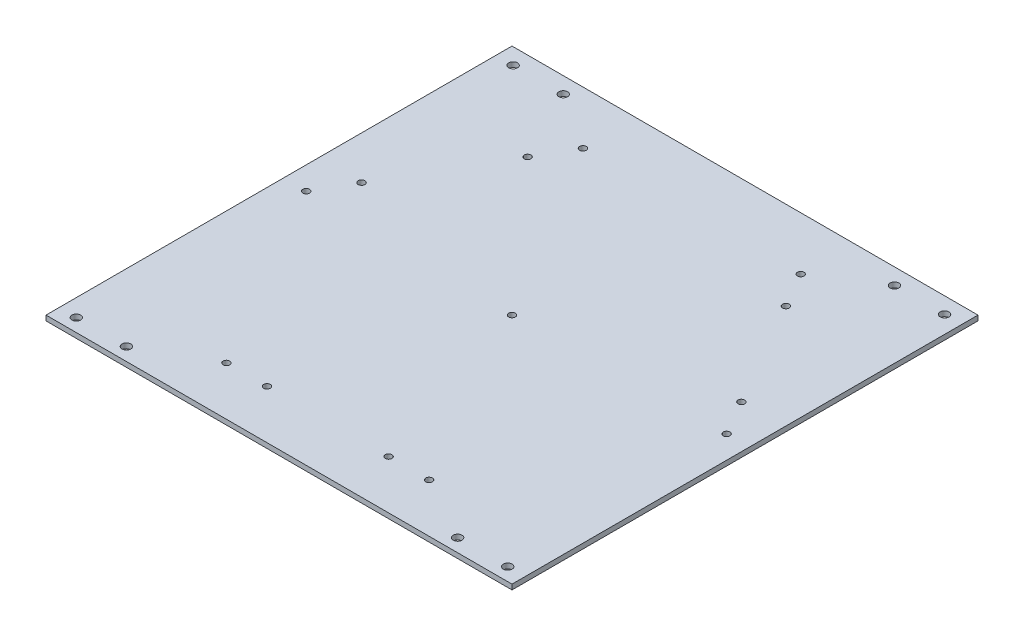
ISO-10303-21;
HEADER;
FILE_DESCRIPTION(('STEP AP214'),'2;1');
FILE_NAME('part.step','',(''),(''),'','','');
FILE_SCHEMA(('AUTOMOTIVE_DESIGN { 1 0 10303 214 1 1 1 1 }'));
ENDSEC;
DATA;
#1=APPLICATION_CONTEXT('core data for automotive mechanical design processes');
#2=APPLICATION_PROTOCOL_DEFINITION('international standard','automotive_design',2000,#1);
#3=PRODUCT_CONTEXT('',#1,'mechanical');
#4=PRODUCT('Part','Part','',(#3));
#5=PRODUCT_RELATED_PRODUCT_CATEGORY('part','',(#4));
#6=PRODUCT_DEFINITION_FORMATION('','',#4);
#7=PRODUCT_DEFINITION_CONTEXT('part definition',#1,'design');
#8=PRODUCT_DEFINITION('design','',#6,#7);
#9=PRODUCT_DEFINITION_SHAPE('','',#8);
#10=(LENGTH_UNIT() NAMED_UNIT(*) SI_UNIT(.MILLI.,.METRE.));
#11=(NAMED_UNIT(*) PLANE_ANGLE_UNIT() SI_UNIT($,.RADIAN.));
#12=(NAMED_UNIT(*) SI_UNIT($,.STERADIAN.) SOLID_ANGLE_UNIT());
#13=UNCERTAINTY_MEASURE_WITH_UNIT(LENGTH_MEASURE(1.E-05),#10,'distance_accuracy_value','');
#14=(GEOMETRIC_REPRESENTATION_CONTEXT(3) GLOBAL_UNCERTAINTY_ASSIGNED_CONTEXT((#13)) GLOBAL_UNIT_ASSIGNED_CONTEXT((#10,
#11,#12)) REPRESENTATION_CONTEXT('',''));
#15=CARTESIAN_POINT('',(0.,0.,0.));
#16=DIRECTION('',(0.,0.,1.));
#17=DIRECTION('',(1.,0.,0.));
#18=AXIS2_PLACEMENT_3D('',#15,#16,#17);
#19=CARTESIAN_POINT('',(146.05,3.175,146.05));
#20=DIRECTION('',(-1.,0.,0.));
#21=DIRECTION('',(0.,0.,1.));
#22=AXIS2_PLACEMENT_3D('',#19,#20,#21);
#23=PLANE('',#22);
#24=DIRECTION('',(0.,0.,-1.));
#25=VECTOR('',#24,1.);
#26=CARTESIAN_POINT('',(146.05,0.,146.05));
#27=LINE('',#26,#25);
#28=CARTESIAN_POINT('',(146.05,0.,146.05));
#29=VERTEX_POINT('',#28);
#30=CARTESIAN_POINT('',(146.05,0.,-146.05));
#31=VERTEX_POINT('',#30);
#32=EDGE_CURVE('E100',#29,#31,#27,.T.);
#33=ORIENTED_EDGE('',*,*,#32,.T.);
#34=DIRECTION('',(0.,-1.,0.));
#35=VECTOR('',#34,1.);
#36=CARTESIAN_POINT('',(146.05,3.175,-146.05));
#37=LINE('',#36,#35);
#38=CARTESIAN_POINT('',(146.05,3.175,-146.05));
#39=VERTEX_POINT('',#38);
#40=EDGE_CURVE('E11',#39,#31,#37,.T.);
#41=ORIENTED_EDGE('',*,*,#40,.F.);
#42=DIRECTION('',(0.,0.,-1.));
#43=VECTOR('',#42,1.);
#44=CARTESIAN_POINT('',(146.05,3.175,146.05));
#45=LINE('',#44,#43);
#46=CARTESIAN_POINT('',(146.05,3.175,146.05));
#47=VERTEX_POINT('',#46);
#48=EDGE_CURVE('E87',#47,#39,#45,.T.);
#49=ORIENTED_EDGE('',*,*,#48,.F.);
#50=DIRECTION('',(0.,-1.,0.));
#51=VECTOR('',#50,1.);
#52=CARTESIAN_POINT('',(146.05,3.175,146.05));
#53=LINE('',#52,#51);
#54=EDGE_CURVE('E96',#47,#29,#53,.T.);
#55=ORIENTED_EDGE('',*,*,#54,.T.);
#56=EDGE_LOOP('',(#33,#41,#49,#55));
#57=FACE_BOUND('',#56,.T.);
#58=ADVANCED_FACE('F34',(#57),#23,.F.);
#59=CARTESIAN_POINT('',(146.05,3.175,-146.05));
#60=DIRECTION('',(0.,0.,1.));
#61=DIRECTION('',(1.,0.,0.));
#62=AXIS2_PLACEMENT_3D('',#59,#60,#61);
#63=PLANE('',#62);
#64=DIRECTION('',(-1.,0.,0.));
#65=VECTOR('',#64,1.);
#66=CARTESIAN_POINT('',(146.05,0.,-146.05));
#67=LINE('',#66,#65);
#68=CARTESIAN_POINT('',(-146.05,0.,-146.05));
#69=VERTEX_POINT('',#68);
#70=EDGE_CURVE('E91',#31,#69,#67,.T.);
#71=ORIENTED_EDGE('',*,*,#70,.T.);
#72=DIRECTION('',(0.,-1.,0.));
#73=VECTOR('',#72,1.);
#74=CARTESIAN_POINT('',(-146.05,3.175,-146.05));
#75=LINE('',#74,#73);
#76=CARTESIAN_POINT('',(-146.05,3.175,-146.05));
#77=VERTEX_POINT('',#76);
#78=EDGE_CURVE('E43',#77,#69,#75,.T.);
#79=ORIENTED_EDGE('',*,*,#78,.F.);
#80=DIRECTION('',(-1.,0.,0.));
#81=VECTOR('',#80,1.);
#82=CARTESIAN_POINT('',(146.05,3.175,-146.05));
#83=LINE('',#82,#81);
#84=EDGE_CURVE('E82',#39,#77,#83,.T.);
#85=ORIENTED_EDGE('',*,*,#84,.F.);
#86=ORIENTED_EDGE('',*,*,#40,.T.);
#87=EDGE_LOOP('',(#71,#79,#85,#86));
#88=FACE_BOUND('',#87,.T.);
#89=ADVANCED_FACE('F90',(#88),#63,.F.);
#90=CARTESIAN_POINT('',(-146.05,3.175,-146.05));
#91=DIRECTION('',(1.,0.,0.));
#92=DIRECTION('',(0.,0.,-1.));
#93=AXIS2_PLACEMENT_3D('',#90,#91,#92);
#94=PLANE('',#93);
#95=DIRECTION('',(0.,0.,1.));
#96=VECTOR('',#95,1.);
#97=CARTESIAN_POINT('',(-146.05,0.,-146.05));
#98=LINE('',#97,#96);
#99=CARTESIAN_POINT('',(-146.05,0.,146.05));
#100=VERTEX_POINT('',#99);
#101=EDGE_CURVE('E69',#69,#100,#98,.T.);
#102=ORIENTED_EDGE('',*,*,#101,.T.);
#103=DIRECTION('',(0.,-1.,0.));
#104=VECTOR('',#103,1.);
#105=CARTESIAN_POINT('',(-146.05,3.175,146.05));
#106=LINE('',#105,#104);
#107=CARTESIAN_POINT('',(-146.05,3.175,146.05));
#108=VERTEX_POINT('',#107);
#109=EDGE_CURVE('E92',#108,#100,#106,.T.);
#110=ORIENTED_EDGE('',*,*,#109,.F.);
#111=DIRECTION('',(0.,0.,1.));
#112=VECTOR('',#111,1.);
#113=CARTESIAN_POINT('',(-146.05,3.175,-146.05));
#114=LINE('',#113,#112);
#115=EDGE_CURVE('E85',#77,#108,#114,.T.);
#116=ORIENTED_EDGE('',*,*,#115,.F.);
#117=ORIENTED_EDGE('',*,*,#78,.T.);
#118=EDGE_LOOP('',(#102,#110,#116,#117));
#119=FACE_BOUND('',#118,.T.);
#120=ADVANCED_FACE('F94',(#119),#94,.F.);
#121=CARTESIAN_POINT('',(-146.05,3.175,146.05));
#122=DIRECTION('',(0.,0.,-1.));
#123=DIRECTION('',(-1.,0.,0.));
#124=AXIS2_PLACEMENT_3D('',#121,#122,#123);
#125=PLANE('',#124);
#126=DIRECTION('',(1.,0.,0.));
#127=VECTOR('',#126,1.);
#128=CARTESIAN_POINT('',(-146.05,0.,146.05));
#129=LINE('',#128,#127);
#130=EDGE_CURVE('E75',#100,#29,#129,.T.);
#131=ORIENTED_EDGE('',*,*,#130,.T.);
#132=ORIENTED_EDGE('',*,*,#54,.F.);
#133=DIRECTION('',(1.,0.,0.));
#134=VECTOR('',#133,1.);
#135=CARTESIAN_POINT('',(-146.05,3.175,146.05));
#136=LINE('',#135,#134);
#137=EDGE_CURVE('E52',#108,#47,#136,.T.);
#138=ORIENTED_EDGE('',*,*,#137,.F.);
#139=ORIENTED_EDGE('',*,*,#109,.T.);
#140=EDGE_LOOP('',(#131,#132,#138,#139));
#141=FACE_BOUND('',#140,.T.);
#142=ADVANCED_FACE('F241',(#141),#125,.F.);
#143=CARTESIAN_POINT('',(0.,3.175,0.));
#144=DIRECTION('',(0.,1.,0.));
#145=DIRECTION('',(0.,0.,1.));
#146=AXIS2_PLACEMENT_3D('',#143,#144,#145);
#147=PLANE('',#146);
#148=CARTESIAN_POINT('',(-135.216191685218,3.175,137.892013655062));
#149=DIRECTION('',(0.,1.,0.));
#150=DIRECTION('',(0.,0.,1.));
#151=AXIS2_PLACEMENT_3D('',#148,#149,#150);
#152=CIRCLE('',#151,2.75);
#153=CARTESIAN_POINT('',(-135.216191685218,3.175,140.642013655062));
#154=VERTEX_POINT('',#153);
#155=EDGE_CURVE('E502',#154,#154,#152,.T.);
#156=ORIENTED_EDGE('',*,*,#155,.F.);
#157=EDGE_LOOP('',(#156));
#158=FACE_BOUND('',#157,.T.);
#159=CARTESIAN_POINT('',(-103.802039506819,3.175,137.892013655062));
#160=DIRECTION('',(0.,1.,0.));
#161=DIRECTION('',(0.,0.,1.));
#162=AXIS2_PLACEMENT_3D('',#159,#160,#161);
#163=CIRCLE('',#162,2.75);
#164=CARTESIAN_POINT('',(-103.802039506819,3.175,140.642013655062));
#165=VERTEX_POINT('',#164);
#166=EDGE_CURVE('E137',#165,#165,#163,.T.);
#167=ORIENTED_EDGE('',*,*,#166,.F.);
#168=EDGE_LOOP('',(#167));
#169=FACE_BOUND('',#168,.T.);
#170=CARTESIAN_POINT('',(103.802039506819,3.175,137.892013655062));
#171=DIRECTION('',(0.,1.,0.));
#172=DIRECTION('',(0.,0.,1.));
#173=AXIS2_PLACEMENT_3D('',#170,#171,#172);
#174=CIRCLE('',#173,2.75);
#175=CARTESIAN_POINT('',(103.802039506819,3.175,140.642013655062));
#176=VERTEX_POINT('',#175);
#177=EDGE_CURVE('E127',#176,#176,#174,.T.);
#178=ORIENTED_EDGE('',*,*,#177,.F.);
#179=EDGE_LOOP('',(#178));
#180=FACE_BOUND('',#179,.T.);
#181=CARTESIAN_POINT('',(135.216191685218,3.175,137.892013655062));
#182=DIRECTION('',(0.,1.,0.));
#183=DIRECTION('',(0.,0.,1.));
#184=AXIS2_PLACEMENT_3D('',#181,#182,#183);
#185=CIRCLE('',#184,2.75);
#186=CARTESIAN_POINT('',(135.216191685218,3.175,140.642013655062));
#187=VERTEX_POINT('',#186);
#188=EDGE_CURVE('E124',#187,#187,#185,.T.);
#189=ORIENTED_EDGE('',*,*,#188,.F.);
#190=EDGE_LOOP('',(#189));
#191=FACE_BOUND('',#190,.T.);
#192=CARTESIAN_POINT('',(103.802039506819,3.175,-135.926865034261));
#193=DIRECTION('',(0.,1.,0.));
#194=DIRECTION('',(0.,0.,1.));
#195=AXIS2_PLACEMENT_3D('',#192,#193,#194);
#196=CIRCLE('',#195,2.75);
#197=CARTESIAN_POINT('',(103.802039506819,3.175,-133.176865034261));
#198=VERTEX_POINT('',#197);
#199=EDGE_CURVE('E121',#198,#198,#196,.T.);
#200=ORIENTED_EDGE('',*,*,#199,.F.);
#201=EDGE_LOOP('',(#200));
#202=FACE_BOUND('',#201,.T.);
#203=CARTESIAN_POINT('',(135.216191685218,3.175,-135.926865034261));
#204=DIRECTION('',(0.,1.,0.));
#205=DIRECTION('',(0.,0.,1.));
#206=AXIS2_PLACEMENT_3D('',#203,#204,#205);
#207=CIRCLE('',#206,2.75);
#208=CARTESIAN_POINT('',(135.216191685218,3.175,-133.176865034261));
#209=VERTEX_POINT('',#208);
#210=EDGE_CURVE('E117',#209,#209,#207,.T.);
#211=ORIENTED_EDGE('',*,*,#210,.F.);
#212=EDGE_LOOP('',(#211));
#213=FACE_BOUND('',#212,.T.);
#214=CARTESIAN_POINT('',(-135.216191685218,3.175,-135.926865034261));
#215=DIRECTION('',(0.,1.,0.));
#216=DIRECTION('',(0.,0.,1.));
#217=AXIS2_PLACEMENT_3D('',#214,#215,#216);
#218=CIRCLE('',#217,2.75);
#219=CARTESIAN_POINT('',(-135.216191685218,3.175,-133.176865034261));
#220=VERTEX_POINT('',#219);
#221=EDGE_CURVE('E113',#220,#220,#218,.T.);
#222=ORIENTED_EDGE('',*,*,#221,.F.);
#223=EDGE_LOOP('',(#222));
#224=FACE_BOUND('',#223,.T.);
#225=CARTESIAN_POINT('',(-103.802039506819,3.175,-135.926865034261));
#226=DIRECTION('',(0.,1.,0.));
#227=DIRECTION('',(0.,0.,1.));
#228=AXIS2_PLACEMENT_3D('',#225,#226,#227);
#229=CIRCLE('',#228,2.75);
#230=CARTESIAN_POINT('',(-103.802039506819,3.175,-133.176865034261));
#231=VERTEX_POINT('',#230);
#232=EDGE_CURVE('E112',#231,#231,#229,.T.);
#233=ORIENTED_EDGE('',*,*,#232,.F.);
#234=EDGE_LOOP('',(#233));
#235=FACE_BOUND('',#234,.T.);
#236=CARTESIAN_POINT('',(-63.5,3.175,115.484487594655));
#237=DIRECTION('',(0.,1.,0.));
#238=DIRECTION('',(0.,0.,1.));
#239=AXIS2_PLACEMENT_3D('',#236,#237,#238);
#240=CIRCLE('',#239,2.09999999999999);
#241=CARTESIAN_POINT('',(-63.5,3.175,117.584487594655));
#242=VERTEX_POINT('',#241);
#243=EDGE_CURVE('E152',#242,#242,#240,.T.);
#244=ORIENTED_EDGE('',*,*,#243,.F.);
#245=EDGE_LOOP('',(#244));
#246=FACE_BOUND('',#245,.T.);
#247=CARTESIAN_POINT('',(-38.1,3.175,115.484487594655));
#248=DIRECTION('',(0.,1.,0.));
#249=DIRECTION('',(0.,0.,1.));
#250=AXIS2_PLACEMENT_3D('',#247,#248,#249);
#251=CIRCLE('',#250,2.09999999999999);
#252=CARTESIAN_POINT('',(-38.1,3.175,117.584487594655));
#253=VERTEX_POINT('',#252);
#254=EDGE_CURVE('E158',#253,#253,#251,.T.);
#255=ORIENTED_EDGE('',*,*,#254,.F.);
#256=EDGE_LOOP('',(#255));
#257=FACE_BOUND('',#256,.T.);
#258=CARTESIAN_POINT('',(38.1,3.175,115.484487594655));
#259=DIRECTION('',(0.,1.,0.));
#260=DIRECTION('',(0.,0.,1.));
#261=AXIS2_PLACEMENT_3D('',#258,#259,#260);
#262=CIRCLE('',#261,2.09999999999999);
#263=CARTESIAN_POINT('',(38.1,3.175,117.584487594655));
#264=VERTEX_POINT('',#263);
#265=EDGE_CURVE('E164',#264,#264,#262,.T.);
#266=ORIENTED_EDGE('',*,*,#265,.F.);
#267=EDGE_LOOP('',(#266));
#268=FACE_BOUND('',#267,.T.);
#269=CARTESIAN_POINT('',(63.5,3.175,115.484487594655));
#270=DIRECTION('',(0.,1.,0.));
#271=DIRECTION('',(0.,0.,1.));
#272=AXIS2_PLACEMENT_3D('',#269,#270,#271);
#273=CIRCLE('',#272,2.09999999999999);
#274=CARTESIAN_POINT('',(63.5,3.175,117.584487594655));
#275=VERTEX_POINT('',#274);
#276=EDGE_CURVE('E170',#275,#275,#273,.T.);
#277=ORIENTED_EDGE('',*,*,#276,.F.);
#278=EDGE_LOOP('',(#277));
#279=FACE_BOUND('',#278,.T.);
#280=CARTESIAN_POINT('',(-68.2625,3.175,-112.73485693764));
#281=DIRECTION('',(0.,1.,0.));
#282=DIRECTION('',(0.,0.,1.));
#283=AXIS2_PLACEMENT_3D('',#280,#281,#282);
#284=CIRCLE('',#283,2.09999999999999);
#285=CARTESIAN_POINT('',(-68.2625,3.175,-110.63485693764));
#286=VERTEX_POINT('',#285);
#287=EDGE_CURVE('E176',#286,#286,#284,.T.);
#288=ORIENTED_EDGE('',*,*,#287,.F.);
#289=EDGE_LOOP('',(#288));
#290=FACE_BOUND('',#289,.T.);
#291=CARTESIAN_POINT('',(-80.9625,3.175,-90.7378116815152));
#292=DIRECTION('',(0.,1.,0.));
#293=DIRECTION('',(0.,0.,1.));
#294=AXIS2_PLACEMENT_3D('',#291,#292,#293);
#295=CIRCLE('',#294,2.09999999999999);
#296=CARTESIAN_POINT('',(-80.9625,3.175,-88.6378116815152));
#297=VERTEX_POINT('',#296);
#298=EDGE_CURVE('E182',#297,#297,#295,.T.);
#299=ORIENTED_EDGE('',*,*,#298,.F.);
#300=EDGE_LOOP('',(#299));
#301=FACE_BOUND('',#300,.T.);
#302=CARTESIAN_POINT('',(-119.0625,3.175,-24.7466759131409));
#303=DIRECTION('',(0.,1.,0.));
#304=DIRECTION('',(0.,0.,1.));
#305=AXIS2_PLACEMENT_3D('',#302,#303,#304);
#306=CIRCLE('',#305,2.09999999999999);
#307=CARTESIAN_POINT('',(-119.0625,3.175,-22.6466759131409));
#308=VERTEX_POINT('',#307);
#309=EDGE_CURVE('E188',#308,#308,#306,.T.);
#310=ORIENTED_EDGE('',*,*,#309,.F.);
#311=EDGE_LOOP('',(#310));
#312=FACE_BOUND('',#311,.T.);
#313=CARTESIAN_POINT('',(-131.7625,3.175,-2.74963065701621));
#314=DIRECTION('',(0.,1.,0.));
#315=DIRECTION('',(0.,0.,1.));
#316=AXIS2_PLACEMENT_3D('',#313,#314,#315);
#317=CIRCLE('',#316,2.09999999999999);
#318=CARTESIAN_POINT('',(-131.7625,3.175,-0.649630657016217));
#319=VERTEX_POINT('',#318);
#320=EDGE_CURVE('E194',#319,#319,#317,.T.);
#321=ORIENTED_EDGE('',*,*,#320,.F.);
#322=EDGE_LOOP('',(#321));
#323=FACE_BOUND('',#322,.T.);
#324=CARTESIAN_POINT('',(131.762500000001,3.175,-2.74963065701588));
#325=DIRECTION('',(0.,1.,0.));
#326=DIRECTION('',(0.,0.,1.));
#327=AXIS2_PLACEMENT_3D('',#324,#325,#326);
#328=CIRCLE('',#327,2.09999999999999);
#329=CARTESIAN_POINT('',(131.762500000001,3.175,-0.649630657015886));
#330=VERTEX_POINT('',#329);
#331=EDGE_CURVE('E200',#330,#330,#328,.T.);
#332=ORIENTED_EDGE('',*,*,#331,.F.);
#333=EDGE_LOOP('',(#332));
#334=FACE_BOUND('',#333,.T.);
#335=CARTESIAN_POINT('',(119.062500000001,3.175,-24.7466759131406));
#336=DIRECTION('',(0.,1.,0.));
#337=DIRECTION('',(0.,0.,1.));
#338=AXIS2_PLACEMENT_3D('',#335,#336,#337);
#339=CIRCLE('',#338,2.09999999999999);
#340=CARTESIAN_POINT('',(119.062500000001,3.175,-22.6466759131406));
#341=VERTEX_POINT('',#340);
#342=EDGE_CURVE('E206',#341,#341,#339,.T.);
#343=ORIENTED_EDGE('',*,*,#342,.F.);
#344=EDGE_LOOP('',(#343));
#345=FACE_BOUND('',#344,.T.);
#346=CARTESIAN_POINT('',(80.9625000000006,3.175,-90.7378116815149));
#347=DIRECTION('',(0.,1.,0.));
#348=DIRECTION('',(0.,0.,1.));
#349=AXIS2_PLACEMENT_3D('',#346,#347,#348);
#350=CIRCLE('',#349,2.09999999999999);
#351=CARTESIAN_POINT('',(80.9625000000006,3.175,-88.6378116815149));
#352=VERTEX_POINT('',#351);
#353=EDGE_CURVE('E212',#352,#352,#350,.T.);
#354=ORIENTED_EDGE('',*,*,#353,.F.);
#355=EDGE_LOOP('',(#354));
#356=FACE_BOUND('',#355,.T.);
#357=CARTESIAN_POINT('',(68.2625000000006,3.175,-112.73485693764));
#358=DIRECTION('',(0.,1.,0.));
#359=DIRECTION('',(0.,0.,1.));
#360=AXIS2_PLACEMENT_3D('',#357,#358,#359);
#361=CIRCLE('',#360,2.09999999999999);
#362=CARTESIAN_POINT('',(68.2625000000006,3.175,-110.63485693764));
#363=VERTEX_POINT('',#362);
#364=EDGE_CURVE('E218',#363,#363,#361,.T.);
#365=ORIENTED_EDGE('',*,*,#364,.F.);
#366=EDGE_LOOP('',(#365));
#367=FACE_BOUND('',#366,.T.);
#368=CARTESIAN_POINT('',(1.94289029309402E-13,3.175,-3.19189119579733E-13));
#369=DIRECTION('',(0.,1.,0.));
#370=DIRECTION('',(0.,0.,1.));
#371=AXIS2_PLACEMENT_3D('',#368,#369,#370);
#372=CIRCLE('',#371,2.09999999999999);
#373=CARTESIAN_POINT('',(1.94289029309402E-13,3.175,2.09999999999967));
#374=VERTEX_POINT('',#373);
#375=EDGE_CURVE('E224',#374,#374,#372,.T.);
#376=ORIENTED_EDGE('',*,*,#375,.F.);
#377=EDGE_LOOP('',(#376));
#378=FACE_BOUND('',#377,.T.);
#379=ORIENTED_EDGE('',*,*,#48,.T.);
#380=ORIENTED_EDGE('',*,*,#84,.T.);
#381=ORIENTED_EDGE('',*,*,#115,.T.);
#382=ORIENTED_EDGE('',*,*,#137,.T.);
#383=EDGE_LOOP('',(#379,#380,#381,#382));
#384=FACE_BOUND('',#383,.T.);
#385=ADVANCED_FACE('F83',(#158,#169,#180,#191,#202,#213,#224,#235,#246,#257,#268,#279,#290,#301,
#312,#323,#334,#345,#356,#367,#378,#384),#147,.T.);
#386=CARTESIAN_POINT('',(0.,0.,0.));
#387=DIRECTION('',(0.,1.,0.));
#388=DIRECTION('',(0.,0.,1.));
#389=AXIS2_PLACEMENT_3D('',#386,#387,#388);
#390=PLANE('',#389);
#391=CARTESIAN_POINT('',(-135.216191685218,0.,137.892013655062));
#392=DIRECTION('',(0.,1.,0.));
#393=DIRECTION('',(0.,0.,1.));
#394=AXIS2_PLACEMENT_3D('',#391,#392,#393);
#395=CIRCLE('',#394,2.75);
#396=CARTESIAN_POINT('',(-135.216191685218,0.,140.642013655062));
#397=VERTEX_POINT('',#396);
#398=EDGE_CURVE('E505',#397,#397,#395,.T.);
#399=ORIENTED_EDGE('',*,*,#398,.T.);
#400=EDGE_LOOP('',(#399));
#401=FACE_BOUND('',#400,.T.);
#402=CARTESIAN_POINT('',(-103.802039506819,0.,137.892013655062));
#403=DIRECTION('',(0.,1.,0.));
#404=DIRECTION('',(0.,0.,1.));
#405=AXIS2_PLACEMENT_3D('',#402,#403,#404);
#406=CIRCLE('',#405,2.75);
#407=CARTESIAN_POINT('',(-103.802039506819,0.,140.642013655062));
#408=VERTEX_POINT('',#407);
#409=EDGE_CURVE('E37',#408,#408,#406,.T.);
#410=ORIENTED_EDGE('',*,*,#409,.T.);
#411=EDGE_LOOP('',(#410));
#412=FACE_BOUND('',#411,.T.);
#413=CARTESIAN_POINT('',(103.802039506819,0.,137.892013655062));
#414=DIRECTION('',(0.,1.,0.));
#415=DIRECTION('',(0.,0.,1.));
#416=AXIS2_PLACEMENT_3D('',#413,#414,#415);
#417=CIRCLE('',#416,2.75);
#418=CARTESIAN_POINT('',(103.802039506819,0.,140.642013655062));
#419=VERTEX_POINT('',#418);
#420=EDGE_CURVE('E125',#419,#419,#417,.T.);
#421=ORIENTED_EDGE('',*,*,#420,.T.);
#422=EDGE_LOOP('',(#421));
#423=FACE_BOUND('',#422,.T.);
#424=CARTESIAN_POINT('',(135.216191685218,0.,137.892013655062));
#425=DIRECTION('',(0.,1.,0.));
#426=DIRECTION('',(0.,0.,1.));
#427=AXIS2_PLACEMENT_3D('',#424,#425,#426);
#428=CIRCLE('',#427,2.75);
#429=CARTESIAN_POINT('',(135.216191685218,0.,140.642013655062));
#430=VERTEX_POINT('',#429);
#431=EDGE_CURVE('E122',#430,#430,#428,.T.);
#432=ORIENTED_EDGE('',*,*,#431,.T.);
#433=EDGE_LOOP('',(#432));
#434=FACE_BOUND('',#433,.T.);
#435=CARTESIAN_POINT('',(103.802039506819,0.,-135.926865034261));
#436=DIRECTION('',(0.,1.,0.));
#437=DIRECTION('',(0.,0.,1.));
#438=AXIS2_PLACEMENT_3D('',#435,#436,#437);
#439=CIRCLE('',#438,2.75);
#440=CARTESIAN_POINT('',(103.802039506819,0.,-133.176865034261));
#441=VERTEX_POINT('',#440);
#442=EDGE_CURVE('E118',#441,#441,#439,.T.);
#443=ORIENTED_EDGE('',*,*,#442,.T.);
#444=EDGE_LOOP('',(#443));
#445=FACE_BOUND('',#444,.T.);
#446=CARTESIAN_POINT('',(135.216191685218,0.,-135.926865034261));
#447=DIRECTION('',(0.,1.,0.));
#448=DIRECTION('',(0.,0.,1.));
#449=AXIS2_PLACEMENT_3D('',#446,#447,#448);
#450=CIRCLE('',#449,2.75);
#451=CARTESIAN_POINT('',(135.216191685218,0.,-133.176865034261));
#452=VERTEX_POINT('',#451);
#453=EDGE_CURVE('E114',#452,#452,#450,.T.);
#454=ORIENTED_EDGE('',*,*,#453,.T.);
#455=EDGE_LOOP('',(#454));
#456=FACE_BOUND('',#455,.T.);
#457=CARTESIAN_POINT('',(-135.216191685218,0.,-135.926865034261));
#458=DIRECTION('',(0.,1.,0.));
#459=DIRECTION('',(0.,0.,1.));
#460=AXIS2_PLACEMENT_3D('',#457,#458,#459);
#461=CIRCLE('',#460,2.75);
#462=CARTESIAN_POINT('',(-135.216191685218,0.,-133.176865034261));
#463=VERTEX_POINT('',#462);
#464=EDGE_CURVE('E109',#463,#463,#461,.T.);
#465=ORIENTED_EDGE('',*,*,#464,.T.);
#466=EDGE_LOOP('',(#465));
#467=FACE_BOUND('',#466,.T.);
#468=CARTESIAN_POINT('',(-103.802039506819,0.,-135.926865034261));
#469=DIRECTION('',(0.,1.,0.));
#470=DIRECTION('',(0.,0.,1.));
#471=AXIS2_PLACEMENT_3D('',#468,#469,#470);
#472=CIRCLE('',#471,2.75);
#473=CARTESIAN_POINT('',(-103.802039506819,0.,-133.176865034261));
#474=VERTEX_POINT('',#473);
#475=EDGE_CURVE('E149',#474,#474,#472,.T.);
#476=ORIENTED_EDGE('',*,*,#475,.T.);
#477=EDGE_LOOP('',(#476));
#478=FACE_BOUND('',#477,.T.);
#479=CARTESIAN_POINT('',(-63.5,0.,115.484487594655));
#480=DIRECTION('',(0.,1.,0.));
#481=DIRECTION('',(0.,0.,1.));
#482=AXIS2_PLACEMENT_3D('',#479,#480,#481);
#483=CIRCLE('',#482,2.1);
#484=CARTESIAN_POINT('',(-63.5,0.,117.584487594655));
#485=VERTEX_POINT('',#484);
#486=EDGE_CURVE('E155',#485,#485,#483,.T.);
#487=ORIENTED_EDGE('',*,*,#486,.T.);
#488=EDGE_LOOP('',(#487));
#489=FACE_BOUND('',#488,.T.);
#490=CARTESIAN_POINT('',(-38.1,0.,115.484487594655));
#491=DIRECTION('',(0.,1.,0.));
#492=DIRECTION('',(0.,0.,1.));
#493=AXIS2_PLACEMENT_3D('',#490,#491,#492);
#494=CIRCLE('',#493,2.1);
#495=CARTESIAN_POINT('',(-38.1,0.,117.584487594655));
#496=VERTEX_POINT('',#495);
#497=EDGE_CURVE('E161',#496,#496,#494,.T.);
#498=ORIENTED_EDGE('',*,*,#497,.T.);
#499=EDGE_LOOP('',(#498));
#500=FACE_BOUND('',#499,.T.);
#501=CARTESIAN_POINT('',(38.1,0.,115.484487594655));
#502=DIRECTION('',(0.,1.,0.));
#503=DIRECTION('',(0.,0.,1.));
#504=AXIS2_PLACEMENT_3D('',#501,#502,#503);
#505=CIRCLE('',#504,2.1);
#506=CARTESIAN_POINT('',(38.1,0.,117.584487594655));
#507=VERTEX_POINT('',#506);
#508=EDGE_CURVE('E167',#507,#507,#505,.T.);
#509=ORIENTED_EDGE('',*,*,#508,.T.);
#510=EDGE_LOOP('',(#509));
#511=FACE_BOUND('',#510,.T.);
#512=CARTESIAN_POINT('',(63.5,0.,115.484487594655));
#513=DIRECTION('',(0.,1.,0.));
#514=DIRECTION('',(0.,0.,1.));
#515=AXIS2_PLACEMENT_3D('',#512,#513,#514);
#516=CIRCLE('',#515,2.1);
#517=CARTESIAN_POINT('',(63.5,0.,117.584487594655));
#518=VERTEX_POINT('',#517);
#519=EDGE_CURVE('E173',#518,#518,#516,.T.);
#520=ORIENTED_EDGE('',*,*,#519,.T.);
#521=EDGE_LOOP('',(#520));
#522=FACE_BOUND('',#521,.T.);
#523=CARTESIAN_POINT('',(-68.2625,0.,-112.73485693764));
#524=DIRECTION('',(0.,1.,0.));
#525=DIRECTION('',(0.,0.,1.));
#526=AXIS2_PLACEMENT_3D('',#523,#524,#525);
#527=CIRCLE('',#526,2.1);
#528=CARTESIAN_POINT('',(-68.2625,0.,-110.63485693764));
#529=VERTEX_POINT('',#528);
#530=EDGE_CURVE('E179',#529,#529,#527,.T.);
#531=ORIENTED_EDGE('',*,*,#530,.T.);
#532=EDGE_LOOP('',(#531));
#533=FACE_BOUND('',#532,.T.);
#534=CARTESIAN_POINT('',(-80.9625,0.,-90.7378116815152));
#535=DIRECTION('',(0.,1.,0.));
#536=DIRECTION('',(0.,0.,1.));
#537=AXIS2_PLACEMENT_3D('',#534,#535,#536);
#538=CIRCLE('',#537,2.1);
#539=CARTESIAN_POINT('',(-80.9625,0.,-88.6378116815152));
#540=VERTEX_POINT('',#539);
#541=EDGE_CURVE('E185',#540,#540,#538,.T.);
#542=ORIENTED_EDGE('',*,*,#541,.T.);
#543=EDGE_LOOP('',(#542));
#544=FACE_BOUND('',#543,.T.);
#545=CARTESIAN_POINT('',(-119.0625,0.,-24.7466759131409));
#546=DIRECTION('',(0.,1.,0.));
#547=DIRECTION('',(0.,0.,1.));
#548=AXIS2_PLACEMENT_3D('',#545,#546,#547);
#549=CIRCLE('',#548,2.1);
#550=CARTESIAN_POINT('',(-119.0625,0.,-22.6466759131409));
#551=VERTEX_POINT('',#550);
#552=EDGE_CURVE('E191',#551,#551,#549,.T.);
#553=ORIENTED_EDGE('',*,*,#552,.T.);
#554=EDGE_LOOP('',(#553));
#555=FACE_BOUND('',#554,.T.);
#556=CARTESIAN_POINT('',(-131.7625,0.,-2.74963065701621));
#557=DIRECTION('',(0.,1.,0.));
#558=DIRECTION('',(0.,0.,1.));
#559=AXIS2_PLACEMENT_3D('',#556,#557,#558);
#560=CIRCLE('',#559,2.09999999999999);
#561=CARTESIAN_POINT('',(-131.7625,0.,-0.649630657016217));
#562=VERTEX_POINT('',#561);
#563=EDGE_CURVE('E197',#562,#562,#560,.T.);
#564=ORIENTED_EDGE('',*,*,#563,.T.);
#565=EDGE_LOOP('',(#564));
#566=FACE_BOUND('',#565,.T.);
#567=CARTESIAN_POINT('',(131.762500000001,0.,-2.74963065701588));
#568=DIRECTION('',(0.,1.,0.));
#569=DIRECTION('',(0.,0.,1.));
#570=AXIS2_PLACEMENT_3D('',#567,#568,#569);
#571=CIRCLE('',#570,2.09999999999999);
#572=CARTESIAN_POINT('',(131.762500000001,0.,-0.649630657015886));
#573=VERTEX_POINT('',#572);
#574=EDGE_CURVE('E203',#573,#573,#571,.T.);
#575=ORIENTED_EDGE('',*,*,#574,.T.);
#576=EDGE_LOOP('',(#575));
#577=FACE_BOUND('',#576,.T.);
#578=CARTESIAN_POINT('',(119.062500000001,0.,-24.7466759131406));
#579=DIRECTION('',(0.,1.,0.));
#580=DIRECTION('',(0.,0.,1.));
#581=AXIS2_PLACEMENT_3D('',#578,#579,#580);
#582=CIRCLE('',#581,2.1);
#583=CARTESIAN_POINT('',(119.062500000001,0.,-22.6466759131406));
#584=VERTEX_POINT('',#583);
#585=EDGE_CURVE('E209',#584,#584,#582,.T.);
#586=ORIENTED_EDGE('',*,*,#585,.T.);
#587=EDGE_LOOP('',(#586));
#588=FACE_BOUND('',#587,.T.);
#589=CARTESIAN_POINT('',(80.9625000000006,0.,-90.7378116815149));
#590=DIRECTION('',(0.,1.,0.));
#591=DIRECTION('',(0.,0.,1.));
#592=AXIS2_PLACEMENT_3D('',#589,#590,#591);
#593=CIRCLE('',#592,2.1);
#594=CARTESIAN_POINT('',(80.9625000000006,0.,-88.6378116815149));
#595=VERTEX_POINT('',#594);
#596=EDGE_CURVE('E215',#595,#595,#593,.T.);
#597=ORIENTED_EDGE('',*,*,#596,.T.);
#598=EDGE_LOOP('',(#597));
#599=FACE_BOUND('',#598,.T.);
#600=CARTESIAN_POINT('',(68.2625000000006,0.,-112.73485693764));
#601=DIRECTION('',(0.,1.,0.));
#602=DIRECTION('',(0.,0.,1.));
#603=AXIS2_PLACEMENT_3D('',#600,#601,#602);
#604=CIRCLE('',#603,2.1);
#605=CARTESIAN_POINT('',(68.2625000000006,0.,-110.63485693764));
#606=VERTEX_POINT('',#605);
#607=EDGE_CURVE('E221',#606,#606,#604,.T.);
#608=ORIENTED_EDGE('',*,*,#607,.T.);
#609=EDGE_LOOP('',(#608));
#610=FACE_BOUND('',#609,.T.);
#611=CARTESIAN_POINT('',(1.94289029309402E-13,0.,-3.19189119579733E-13));
#612=DIRECTION('',(0.,1.,0.));
#613=DIRECTION('',(0.,0.,1.));
#614=AXIS2_PLACEMENT_3D('',#611,#612,#613);
#615=CIRCLE('',#614,2.1);
#616=CARTESIAN_POINT('',(1.94289029309402E-13,0.,2.09999999999968));
#617=VERTEX_POINT('',#616);
#618=EDGE_CURVE('E103',#617,#617,#615,.T.);
#619=ORIENTED_EDGE('',*,*,#618,.T.);
#620=EDGE_LOOP('',(#619));
#621=FACE_BOUND('',#620,.T.);
#622=ORIENTED_EDGE('',*,*,#32,.F.);
#623=ORIENTED_EDGE('',*,*,#130,.F.);
#624=ORIENTED_EDGE('',*,*,#101,.F.);
#625=ORIENTED_EDGE('',*,*,#70,.F.);
#626=EDGE_LOOP('',(#622,#623,#624,#625));
#627=FACE_BOUND('',#626,.T.);
#628=ADVANCED_FACE('F230',(#401,#412,#423,#434,#445,#456,#467,#478,#489,#500,#511,#522,#533,
#544,#555,#566,#577,#588,#599,#610,#621,#627),#390,.F.);
#629=CARTESIAN_POINT('',(1.94289029309402E-13,3.175,-3.19189119579733E-13));
#630=DIRECTION('',(0.,1.,0.));
#631=DIRECTION('',(0.,0.,1.));
#632=AXIS2_PLACEMENT_3D('',#629,#630,#631);
#633=CYLINDRICAL_SURFACE('',#632,2.09999999999999);
#634=ORIENTED_EDGE('',*,*,#618,.F.);
#635=EDGE_LOOP('',(#634));
#636=FACE_BOUND('',#635,.T.);
#637=ORIENTED_EDGE('',*,*,#375,.T.);
#638=EDGE_LOOP('',(#637));
#639=FACE_BOUND('',#638,.T.);
#640=ADVANCED_FACE('F233',(#636,#639),#633,.F.);
#641=CARTESIAN_POINT('',(68.2625000000006,3.175,-112.73485693764));
#642=DIRECTION('',(0.,1.,0.));
#643=DIRECTION('',(0.,0.,1.));
#644=AXIS2_PLACEMENT_3D('',#641,#642,#643);
#645=CYLINDRICAL_SURFACE('',#644,2.1);
#646=ORIENTED_EDGE('',*,*,#607,.F.);
#647=EDGE_LOOP('',(#646));
#648=FACE_BOUND('',#647,.T.);
#649=ORIENTED_EDGE('',*,*,#364,.T.);
#650=EDGE_LOOP('',(#649));
#651=FACE_BOUND('',#650,.T.);
#652=ADVANCED_FACE('F236',(#648,#651),#645,.F.);
#653=CARTESIAN_POINT('',(80.9625000000006,3.175,-90.7378116815149));
#654=DIRECTION('',(0.,1.,0.));
#655=DIRECTION('',(0.,0.,1.));
#656=AXIS2_PLACEMENT_3D('',#653,#654,#655);
#657=CYLINDRICAL_SURFACE('',#656,2.1);
#658=ORIENTED_EDGE('',*,*,#596,.F.);
#659=EDGE_LOOP('',(#658));
#660=FACE_BOUND('',#659,.T.);
#661=ORIENTED_EDGE('',*,*,#353,.T.);
#662=EDGE_LOOP('',(#661));
#663=FACE_BOUND('',#662,.T.);
#664=ADVANCED_FACE('F289',(#660,#663),#657,.F.);
#665=CARTESIAN_POINT('',(119.062500000001,3.175,-24.7466759131406));
#666=DIRECTION('',(0.,1.,0.));
#667=DIRECTION('',(0.,0.,1.));
#668=AXIS2_PLACEMENT_3D('',#665,#666,#667);
#669=CYLINDRICAL_SURFACE('',#668,2.1);
#670=ORIENTED_EDGE('',*,*,#585,.F.);
#671=EDGE_LOOP('',(#670));
#672=FACE_BOUND('',#671,.T.);
#673=ORIENTED_EDGE('',*,*,#342,.T.);
#674=EDGE_LOOP('',(#673));
#675=FACE_BOUND('',#674,.T.);
#676=ADVANCED_FACE('F300',(#672,#675),#669,.F.);
#677=CARTESIAN_POINT('',(131.762500000001,3.175,-2.74963065701588));
#678=DIRECTION('',(0.,1.,0.));
#679=DIRECTION('',(0.,0.,1.));
#680=AXIS2_PLACEMENT_3D('',#677,#678,#679);
#681=CYLINDRICAL_SURFACE('',#680,2.09999999999999);
#682=ORIENTED_EDGE('',*,*,#574,.F.);
#683=EDGE_LOOP('',(#682));
#684=FACE_BOUND('',#683,.T.);
#685=ORIENTED_EDGE('',*,*,#331,.T.);
#686=EDGE_LOOP('',(#685));
#687=FACE_BOUND('',#686,.T.);
#688=ADVANCED_FACE('F311',(#684,#687),#681,.F.);
#689=CARTESIAN_POINT('',(-131.7625,3.175,-2.74963065701621));
#690=DIRECTION('',(0.,1.,0.));
#691=DIRECTION('',(0.,0.,1.));
#692=AXIS2_PLACEMENT_3D('',#689,#690,#691);
#693=CYLINDRICAL_SURFACE('',#692,2.09999999999999);
#694=ORIENTED_EDGE('',*,*,#563,.F.);
#695=EDGE_LOOP('',(#694));
#696=FACE_BOUND('',#695,.T.);
#697=ORIENTED_EDGE('',*,*,#320,.T.);
#698=EDGE_LOOP('',(#697));
#699=FACE_BOUND('',#698,.T.);
#700=ADVANCED_FACE('F322',(#696,#699),#693,.F.);
#701=CARTESIAN_POINT('',(-119.0625,3.175,-24.7466759131409));
#702=DIRECTION('',(0.,1.,0.));
#703=DIRECTION('',(0.,0.,1.));
#704=AXIS2_PLACEMENT_3D('',#701,#702,#703);
#705=CYLINDRICAL_SURFACE('',#704,2.1);
#706=ORIENTED_EDGE('',*,*,#552,.F.);
#707=EDGE_LOOP('',(#706));
#708=FACE_BOUND('',#707,.T.);
#709=ORIENTED_EDGE('',*,*,#309,.T.);
#710=EDGE_LOOP('',(#709));
#711=FACE_BOUND('',#710,.T.);
#712=ADVANCED_FACE('F333',(#708,#711),#705,.F.);
#713=CARTESIAN_POINT('',(-80.9625,3.175,-90.7378116815152));
#714=DIRECTION('',(0.,1.,0.));
#715=DIRECTION('',(0.,0.,1.));
#716=AXIS2_PLACEMENT_3D('',#713,#714,#715);
#717=CYLINDRICAL_SURFACE('',#716,2.1);
#718=ORIENTED_EDGE('',*,*,#541,.F.);
#719=EDGE_LOOP('',(#718));
#720=FACE_BOUND('',#719,.T.);
#721=ORIENTED_EDGE('',*,*,#298,.T.);
#722=EDGE_LOOP('',(#721));
#723=FACE_BOUND('',#722,.T.);
#724=ADVANCED_FACE('F344',(#720,#723),#717,.F.);
#725=CARTESIAN_POINT('',(-68.2625,3.175,-112.73485693764));
#726=DIRECTION('',(0.,1.,0.));
#727=DIRECTION('',(0.,0.,1.));
#728=AXIS2_PLACEMENT_3D('',#725,#726,#727);
#729=CYLINDRICAL_SURFACE('',#728,2.1);
#730=ORIENTED_EDGE('',*,*,#530,.F.);
#731=EDGE_LOOP('',(#730));
#732=FACE_BOUND('',#731,.T.);
#733=ORIENTED_EDGE('',*,*,#287,.T.);
#734=EDGE_LOOP('',(#733));
#735=FACE_BOUND('',#734,.T.);
#736=ADVANCED_FACE('F355',(#732,#735),#729,.F.);
#737=CARTESIAN_POINT('',(63.5,3.175,115.484487594655));
#738=DIRECTION('',(0.,1.,0.));
#739=DIRECTION('',(0.,0.,1.));
#740=AXIS2_PLACEMENT_3D('',#737,#738,#739);
#741=CYLINDRICAL_SURFACE('',#740,2.1);
#742=ORIENTED_EDGE('',*,*,#519,.F.);
#743=EDGE_LOOP('',(#742));
#744=FACE_BOUND('',#743,.T.);
#745=ORIENTED_EDGE('',*,*,#276,.T.);
#746=EDGE_LOOP('',(#745));
#747=FACE_BOUND('',#746,.T.);
#748=ADVANCED_FACE('F366',(#744,#747),#741,.F.);
#749=CARTESIAN_POINT('',(38.1,3.175,115.484487594655));
#750=DIRECTION('',(0.,1.,0.));
#751=DIRECTION('',(0.,0.,1.));
#752=AXIS2_PLACEMENT_3D('',#749,#750,#751);
#753=CYLINDRICAL_SURFACE('',#752,2.09999999999999);
#754=ORIENTED_EDGE('',*,*,#508,.F.);
#755=EDGE_LOOP('',(#754));
#756=FACE_BOUND('',#755,.T.);
#757=ORIENTED_EDGE('',*,*,#265,.T.);
#758=EDGE_LOOP('',(#757));
#759=FACE_BOUND('',#758,.T.);
#760=ADVANCED_FACE('F377',(#756,#759),#753,.F.);
#761=CARTESIAN_POINT('',(-38.1,3.175,115.484487594655));
#762=DIRECTION('',(0.,1.,0.));
#763=DIRECTION('',(0.,0.,1.));
#764=AXIS2_PLACEMENT_3D('',#761,#762,#763);
#765=CYLINDRICAL_SURFACE('',#764,2.09999999999999);
#766=ORIENTED_EDGE('',*,*,#497,.F.);
#767=EDGE_LOOP('',(#766));
#768=FACE_BOUND('',#767,.T.);
#769=ORIENTED_EDGE('',*,*,#254,.T.);
#770=EDGE_LOOP('',(#769));
#771=FACE_BOUND('',#770,.T.);
#772=ADVANCED_FACE('F388',(#768,#771),#765,.F.);
#773=CARTESIAN_POINT('',(-63.5,3.175,115.484487594655));
#774=DIRECTION('',(0.,1.,0.));
#775=DIRECTION('',(0.,0.,1.));
#776=AXIS2_PLACEMENT_3D('',#773,#774,#775);
#777=CYLINDRICAL_SURFACE('',#776,2.09999999999999);
#778=ORIENTED_EDGE('',*,*,#486,.F.);
#779=EDGE_LOOP('',(#778));
#780=FACE_BOUND('',#779,.T.);
#781=ORIENTED_EDGE('',*,*,#243,.T.);
#782=EDGE_LOOP('',(#781));
#783=FACE_BOUND('',#782,.T.);
#784=ADVANCED_FACE('F399',(#780,#783),#777,.F.);
#785=CARTESIAN_POINT('',(-103.802039506819,3.175,-135.926865034261));
#786=DIRECTION('',(0.,1.,0.));
#787=DIRECTION('',(0.,0.,1.));
#788=AXIS2_PLACEMENT_3D('',#785,#786,#787);
#789=CYLINDRICAL_SURFACE('',#788,2.75);
#790=ORIENTED_EDGE('',*,*,#232,.T.);
#791=EDGE_LOOP('',(#790));
#792=FACE_BOUND('',#791,.T.);
#793=ORIENTED_EDGE('',*,*,#475,.F.);
#794=EDGE_LOOP('',(#793));
#795=FACE_BOUND('',#794,.T.);
#796=ADVANCED_FACE('F408',(#792,#795),#789,.F.);
#797=CARTESIAN_POINT('',(-135.216191685218,3.175,-135.926865034261));
#798=DIRECTION('',(0.,1.,0.));
#799=DIRECTION('',(0.,0.,1.));
#800=AXIS2_PLACEMENT_3D('',#797,#798,#799);
#801=CYLINDRICAL_SURFACE('',#800,2.75);
#802=ORIENTED_EDGE('',*,*,#221,.T.);
#803=EDGE_LOOP('',(#802));
#804=FACE_BOUND('',#803,.T.);
#805=ORIENTED_EDGE('',*,*,#464,.F.);
#806=EDGE_LOOP('',(#805));
#807=FACE_BOUND('',#806,.T.);
#808=ADVANCED_FACE('F427',(#804,#807),#801,.F.);
#809=CARTESIAN_POINT('',(135.216191685218,3.175,-135.926865034261));
#810=DIRECTION('',(0.,1.,0.));
#811=DIRECTION('',(0.,0.,1.));
#812=AXIS2_PLACEMENT_3D('',#809,#810,#811);
#813=CYLINDRICAL_SURFACE('',#812,2.75);
#814=ORIENTED_EDGE('',*,*,#210,.T.);
#815=EDGE_LOOP('',(#814));
#816=FACE_BOUND('',#815,.T.);
#817=ORIENTED_EDGE('',*,*,#453,.F.);
#818=EDGE_LOOP('',(#817));
#819=FACE_BOUND('',#818,.T.);
#820=ADVANCED_FACE('F437',(#816,#819),#813,.F.);
#821=CARTESIAN_POINT('',(103.802039506819,3.175,-135.926865034261));
#822=DIRECTION('',(0.,1.,0.));
#823=DIRECTION('',(0.,0.,1.));
#824=AXIS2_PLACEMENT_3D('',#821,#822,#823);
#825=CYLINDRICAL_SURFACE('',#824,2.75);
#826=ORIENTED_EDGE('',*,*,#199,.T.);
#827=EDGE_LOOP('',(#826));
#828=FACE_BOUND('',#827,.T.);
#829=ORIENTED_EDGE('',*,*,#442,.F.);
#830=EDGE_LOOP('',(#829));
#831=FACE_BOUND('',#830,.T.);
#832=ADVANCED_FACE('F447',(#828,#831),#825,.F.);
#833=CARTESIAN_POINT('',(135.216191685218,3.175,137.892013655062));
#834=DIRECTION('',(0.,1.,0.));
#835=DIRECTION('',(0.,0.,1.));
#836=AXIS2_PLACEMENT_3D('',#833,#834,#835);
#837=CYLINDRICAL_SURFACE('',#836,2.75);
#838=ORIENTED_EDGE('',*,*,#188,.T.);
#839=EDGE_LOOP('',(#838));
#840=FACE_BOUND('',#839,.T.);
#841=ORIENTED_EDGE('',*,*,#431,.F.);
#842=EDGE_LOOP('',(#841));
#843=FACE_BOUND('',#842,.T.);
#844=ADVANCED_FACE('F457',(#840,#843),#837,.F.);
#845=CARTESIAN_POINT('',(103.802039506819,3.175,137.892013655062));
#846=DIRECTION('',(0.,1.,0.));
#847=DIRECTION('',(0.,0.,1.));
#848=AXIS2_PLACEMENT_3D('',#845,#846,#847);
#849=CYLINDRICAL_SURFACE('',#848,2.75);
#850=ORIENTED_EDGE('',*,*,#177,.T.);
#851=EDGE_LOOP('',(#850));
#852=FACE_BOUND('',#851,.T.);
#853=ORIENTED_EDGE('',*,*,#420,.F.);
#854=EDGE_LOOP('',(#853));
#855=FACE_BOUND('',#854,.T.);
#856=ADVANCED_FACE('F467',(#852,#855),#849,.F.);
#857=CARTESIAN_POINT('',(-103.802039506819,3.175,137.892013655062));
#858=DIRECTION('',(0.,1.,0.));
#859=DIRECTION('',(0.,0.,1.));
#860=AXIS2_PLACEMENT_3D('',#857,#858,#859);
#861=CYLINDRICAL_SURFACE('',#860,2.75);
#862=ORIENTED_EDGE('',*,*,#166,.T.);
#863=EDGE_LOOP('',(#862));
#864=FACE_BOUND('',#863,.T.);
#865=ORIENTED_EDGE('',*,*,#409,.F.);
#866=EDGE_LOOP('',(#865));
#867=FACE_BOUND('',#866,.T.);
#868=ADVANCED_FACE('F477',(#864,#867),#861,.F.);
#869=CARTESIAN_POINT('',(-135.216191685218,3.175,137.892013655062));
#870=DIRECTION('',(0.,1.,0.));
#871=DIRECTION('',(0.,0.,1.));
#872=AXIS2_PLACEMENT_3D('',#869,#870,#871);
#873=CYLINDRICAL_SURFACE('',#872,2.75);
#874=ORIENTED_EDGE('',*,*,#155,.T.);
#875=EDGE_LOOP('',(#874));
#876=FACE_BOUND('',#875,.T.);
#877=ORIENTED_EDGE('',*,*,#398,.F.);
#878=EDGE_LOOP('',(#877));
#879=FACE_BOUND('',#878,.T.);
#880=ADVANCED_FACE('F486',(#876,#879),#873,.F.);
#881=CLOSED_SHELL('',(#58,#89,#120,#142,#385,#628,#640,#652,#664,#676,#688,#700,#712,#724,#736,
#748,#760,#772,#784,#796,#808,#820,#832,#844,#856,#868,#880));
#882=MANIFOLD_SOLID_BREP('B2',#881);
#883=ADVANCED_BREP_SHAPE_REPRESENTATION('',(#18,#882),#14);
#884=SHAPE_DEFINITION_REPRESENTATION(#9,#883);
ENDSEC;
END-ISO-10303-21;
